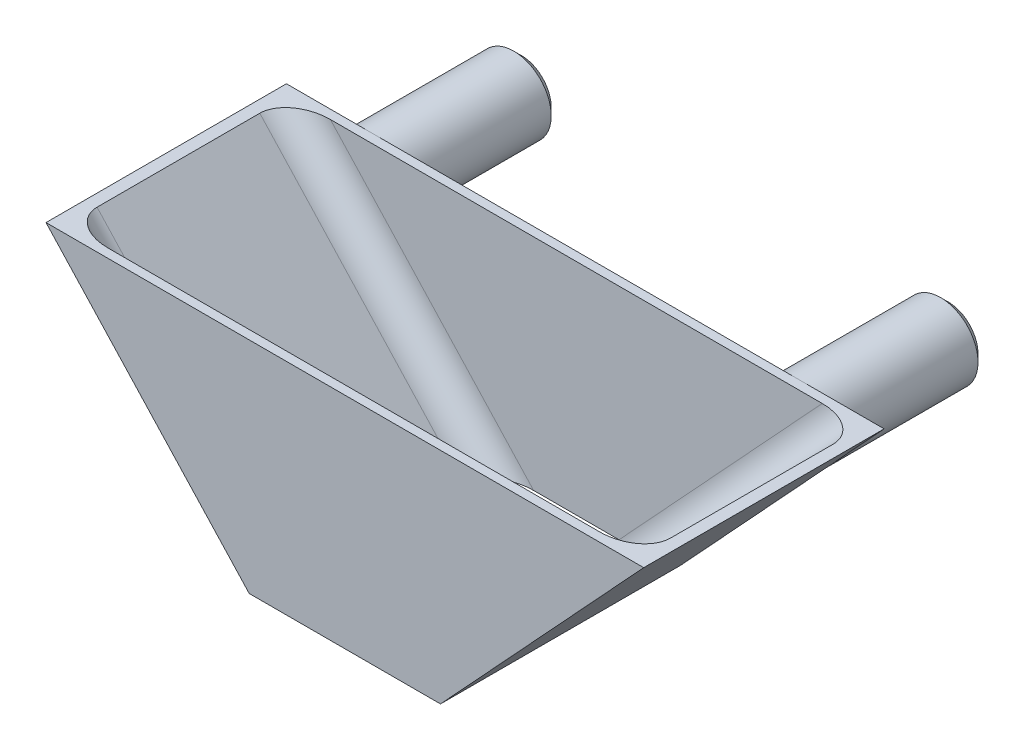
ISO-10303-21;
HEADER;
FILE_DESCRIPTION(('STEP AP214'),'2;1');
FILE_NAME('part.step','',(''),(''),'','','');
FILE_SCHEMA(('AUTOMOTIVE_DESIGN { 1 0 10303 214 1 1 1 1 }'));
ENDSEC;
DATA;
#1=APPLICATION_CONTEXT('core data for automotive mechanical design processes');
#2=APPLICATION_PROTOCOL_DEFINITION('international standard','automotive_design',2000,#1);
#3=PRODUCT_CONTEXT('',#1,'mechanical');
#4=PRODUCT('Part','Part','',(#3));
#5=PRODUCT_RELATED_PRODUCT_CATEGORY('part','',(#4));
#6=PRODUCT_DEFINITION_FORMATION('','',#4);
#7=PRODUCT_DEFINITION_CONTEXT('part definition',#1,'design');
#8=PRODUCT_DEFINITION('design','',#6,#7);
#9=PRODUCT_DEFINITION_SHAPE('','',#8);
#10=(LENGTH_UNIT() NAMED_UNIT(*) SI_UNIT(.MILLI.,.METRE.));
#11=(NAMED_UNIT(*) PLANE_ANGLE_UNIT() SI_UNIT($,.RADIAN.));
#12=(NAMED_UNIT(*) SI_UNIT($,.STERADIAN.) SOLID_ANGLE_UNIT());
#13=UNCERTAINTY_MEASURE_WITH_UNIT(LENGTH_MEASURE(1.E-05),#10,'distance_accuracy_value','');
#14=(GEOMETRIC_REPRESENTATION_CONTEXT(3) GLOBAL_UNCERTAINTY_ASSIGNED_CONTEXT((#13)) GLOBAL_UNIT_ASSIGNED_CONTEXT((#10,
#11,#12)) REPRESENTATION_CONTEXT('',''));
#15=CARTESIAN_POINT('',(0.,0.,0.));
#16=DIRECTION('',(0.,0.,1.));
#17=DIRECTION('',(1.,0.,0.));
#18=AXIS2_PLACEMENT_3D('',#15,#16,#17);
#19=CARTESIAN_POINT('',(0.,0.,0.));
#20=DIRECTION('',(0.,0.,-1.));
#21=DIRECTION('',(-1.,0.,0.));
#22=AXIS2_PLACEMENT_3D('',#19,#20,#21);
#23=PLANE('',#22);
#24=DIRECTION('',(0.679109253274506,-0.734037207583473,0.));
#25=VECTOR('',#24,1.);
#26=CARTESIAN_POINT('',(-6.4,0.,0.));
#27=LINE('',#26,#25);
#28=CARTESIAN_POINT('',(-16.1163459448073,10.5022268668137,0.));
#29=VERTEX_POINT('',#28);
#30=CARTESIAN_POINT('',(-6.4,0.,0.));
#31=VERTEX_POINT('',#30);
#32=EDGE_CURVE('E146',#29,#31,#27,.T.);
#33=ORIENTED_EDGE('',*,*,#32,.F.);
#34=CARTESIAN_POINT('',(-14.2812529258486,12.2,0.));
#35=DIRECTION('',(0.,0.,-1.));
#36=DIRECTION('',(-1.,0.,0.));
#37=AXIS2_PLACEMENT_3D('',#34,#35,#36);
#38=CIRCLE('',#37,2.5);
#39=CARTESIAN_POINT('',(-14.2812529258486,14.7,0.));
#40=VERTEX_POINT('',#39);
#41=EDGE_CURVE('E49',#40,#29,#38,.T.);
#42=ORIENTED_EDGE('',*,*,#41,.F.);
#43=DIRECTION('',(-1.,0.,0.));
#44=VECTOR('',#43,1.);
#45=CARTESIAN_POINT('',(-20.,14.7,0.));
#46=LINE('',#45,#44);
#47=CARTESIAN_POINT('',(14.2812529258486,14.7,0.));
#48=VERTEX_POINT('',#47);
#49=EDGE_CURVE('E143',#48,#40,#46,.T.);
#50=ORIENTED_EDGE('',*,*,#49,.F.);
#51=CARTESIAN_POINT('',(14.2812529258486,12.2,0.));
#52=DIRECTION('',(0.,0.,-1.));
#53=DIRECTION('',(-1.,0.,0.));
#54=AXIS2_PLACEMENT_3D('',#51,#52,#53);
#55=CIRCLE('',#54,2.5);
#56=CARTESIAN_POINT('',(16.1163459448073,10.5022268668137,0.));
#57=VERTEX_POINT('',#56);
#58=EDGE_CURVE('E57',#57,#48,#55,.T.);
#59=ORIENTED_EDGE('',*,*,#58,.F.);
#60=DIRECTION('',(0.679109253274506,0.734037207583473,0.));
#61=VECTOR('',#60,1.);
#62=CARTESIAN_POINT('',(20.,14.7,0.));
#63=LINE('',#62,#61);
#64=CARTESIAN_POINT('',(6.4,0.,0.));
#65=VERTEX_POINT('',#64);
#66=EDGE_CURVE('E156',#65,#57,#63,.T.);
#67=ORIENTED_EDGE('',*,*,#66,.F.);
#68=DIRECTION('',(1.,0.,0.));
#69=VECTOR('',#68,1.);
#70=CARTESIAN_POINT('',(6.4,0.,0.));
#71=LINE('',#70,#69);
#72=EDGE_CURVE('E477',#31,#65,#71,.T.);
#73=ORIENTED_EDGE('',*,*,#72,.F.);
#74=EDGE_LOOP('',(#33,#42,#50,#59,#67,#73));
#75=FACE_BOUND('',#74,.T.);
#76=ADVANCED_FACE('F35',(#75),#23,.T.);
#77=EDGE_CURVE('E148',#48,#57,#55,.T.);
#78=ORIENTED_EDGE('',*,*,#77,.F.);
#79=CARTESIAN_POINT('',(20.,14.7,0.));
#80=VERTEX_POINT('',#79);
#81=EDGE_CURVE('E158',#80,#48,#46,.T.);
#82=ORIENTED_EDGE('',*,*,#81,.F.);
#83=EDGE_CURVE('E451',#57,#80,#63,.T.);
#84=ORIENTED_EDGE('',*,*,#83,.F.);
#85=EDGE_LOOP('',(#78,#82,#84));
#86=FACE_BOUND('',#85,.T.);
#87=ADVANCED_FACE('F233',(#86),#23,.T.);
#88=CARTESIAN_POINT('',(6.4,0.,16.09));
#89=DIRECTION('',(0.,1.,0.));
#90=DIRECTION('',(0.,0.,1.));
#91=AXIS2_PLACEMENT_3D('',#88,#89,#90);
#92=PLANE('',#91);
#93=ORIENTED_EDGE('',*,*,#72,.T.);
#94=DIRECTION('',(0.,0.,-1.));
#95=VECTOR('',#94,1.);
#96=CARTESIAN_POINT('',(6.4,0.,16.09));
#97=LINE('',#96,#95);
#98=CARTESIAN_POINT('',(6.4,0.,16.09));
#99=VERTEX_POINT('',#98);
#100=EDGE_CURVE('E176',#99,#65,#97,.T.);
#101=ORIENTED_EDGE('',*,*,#100,.F.);
#102=DIRECTION('',(1.,0.,0.));
#103=VECTOR('',#102,1.);
#104=CARTESIAN_POINT('',(6.4,0.,16.09));
#105=LINE('',#104,#103);
#106=CARTESIAN_POINT('',(-6.4,0.,16.09));
#107=VERTEX_POINT('',#106);
#108=EDGE_CURVE('E167',#107,#99,#105,.T.);
#109=ORIENTED_EDGE('',*,*,#108,.F.);
#110=DIRECTION('',(0.,0.,-1.));
#111=VECTOR('',#110,1.);
#112=CARTESIAN_POINT('',(-6.4,0.,16.09));
#113=LINE('',#112,#111);
#114=EDGE_CURVE('E168',#107,#31,#113,.T.);
#115=ORIENTED_EDGE('',*,*,#114,.T.);
#116=EDGE_LOOP('',(#93,#101,#109,#115));
#117=FACE_BOUND('',#116,.T.);
#118=DIRECTION('',(1.,0.,0.));
#119=VECTOR('',#118,1.);
#120=CARTESIAN_POINT('',(0.,0.,0.6));
#121=LINE('',#120,#119);
#122=CARTESIAN_POINT('',(-2.85794521975328,0.,0.6));
#123=VERTEX_POINT('',#122);
#124=CARTESIAN_POINT('',(2.85794521975327,0.,0.6));
#125=VERTEX_POINT('',#124);
#126=EDGE_CURVE('E455',#123,#125,#121,.T.);
#127=ORIENTED_EDGE('',*,*,#126,.F.);
#128=CARTESIAN_POINT('',(-2.85794521975327,0.,2.6));
#129=DIRECTION('',(0.,1.,0.));
#130=DIRECTION('',(1.,0.,0.));
#131=AXIS2_PLACEMENT_3D('',#128,#129,#130);
#132=ELLIPSE('',#131,2.72465752326671,2.);
#133=CARTESIAN_POINT('',(-5.58260274301999,0.,2.6));
#134=VERTEX_POINT('',#133);
#135=EDGE_CURVE('E211',#123,#134,#132,.T.);
#136=ORIENTED_EDGE('',*,*,#135,.T.);
#137=DIRECTION('',(0.,0.,-1.));
#138=VECTOR('',#137,1.);
#139=CARTESIAN_POINT('',(-5.58260274301999,0.,16.09));
#140=LINE('',#139,#138);
#141=CARTESIAN_POINT('',(-5.58260274301999,0.,13.49));
#142=VERTEX_POINT('',#141);
#143=EDGE_CURVE('E471',#142,#134,#140,.T.);
#144=ORIENTED_EDGE('',*,*,#143,.F.);
#145=CARTESIAN_POINT('',(-2.85794521975327,0.,13.49));
#146=DIRECTION('',(0.,1.,0.));
#147=DIRECTION('',(-1.,0.,0.));
#148=AXIS2_PLACEMENT_3D('',#145,#146,#147);
#149=ELLIPSE('',#148,2.72465752326671,2.);
#150=CARTESIAN_POINT('',(-2.85794521975327,0.,15.49));
#151=VERTEX_POINT('',#150);
#152=EDGE_CURVE('E193',#142,#151,#149,.T.);
#153=ORIENTED_EDGE('',*,*,#152,.T.);
#154=DIRECTION('',(1.,0.,0.));
#155=VECTOR('',#154,1.);
#156=CARTESIAN_POINT('',(0.,0.,15.49));
#157=LINE('',#156,#155);
#158=CARTESIAN_POINT('',(2.85794521975328,0.,15.49));
#159=VERTEX_POINT('',#158);
#160=EDGE_CURVE('E468',#151,#159,#157,.T.);
#161=ORIENTED_EDGE('',*,*,#160,.T.);
#162=CARTESIAN_POINT('',(2.85794521975327,0.,13.49));
#163=DIRECTION('',(0.,1.,0.));
#164=DIRECTION('',(-1.,0.,0.));
#165=AXIS2_PLACEMENT_3D('',#162,#163,#164);
#166=ELLIPSE('',#165,2.72465752326671,2.);
#167=CARTESIAN_POINT('',(5.58260274301998,0.,13.49));
#168=VERTEX_POINT('',#167);
#169=EDGE_CURVE('E191',#159,#168,#166,.T.);
#170=ORIENTED_EDGE('',*,*,#169,.T.);
#171=DIRECTION('',(0.,0.,-1.));
#172=VECTOR('',#171,1.);
#173=CARTESIAN_POINT('',(5.58260274301998,0.,16.09));
#174=LINE('',#173,#172);
#175=CARTESIAN_POINT('',(5.58260274301998,0.,2.6));
#176=VERTEX_POINT('',#175);
#177=EDGE_CURVE('E464',#168,#176,#174,.T.);
#178=ORIENTED_EDGE('',*,*,#177,.T.);
#179=CARTESIAN_POINT('',(2.85794521975327,0.,2.6));
#180=DIRECTION('',(0.,1.,0.));
#181=DIRECTION('',(1.,0.,0.));
#182=AXIS2_PLACEMENT_3D('',#179,#180,#181);
#183=ELLIPSE('',#182,2.72465752326671,2.);
#184=EDGE_CURVE('E209',#176,#125,#183,.T.);
#185=ORIENTED_EDGE('',*,*,#184,.T.);
#186=EDGE_LOOP('',(#127,#136,#144,#153,#161,#170,#178,#185));
#187=FACE_BOUND('',#186,.T.);
#188=ADVANCED_FACE('F238',(#117,#187),#92,.F.);
#189=CARTESIAN_POINT('',(-20.,14.7,16.09));
#190=DIRECTION('',(0.,-1.,0.));
#191=DIRECTION('',(0.,0.,-1.));
#192=AXIS2_PLACEMENT_3D('',#189,#190,#191);
#193=PLANE('',#192);
#194=ORIENTED_EDGE('',*,*,#81,.T.);
#195=ORIENTED_EDGE('',*,*,#49,.T.);
#196=CARTESIAN_POINT('',(-20.,14.7,0.));
#197=VERTEX_POINT('',#196);
#198=EDGE_CURVE('E150',#40,#197,#46,.T.);
#199=ORIENTED_EDGE('',*,*,#198,.T.);
#200=DIRECTION('',(0.,0.,-1.));
#201=VECTOR('',#200,1.);
#202=CARTESIAN_POINT('',(-20.,14.7,16.09));
#203=LINE('',#202,#201);
#204=CARTESIAN_POINT('',(-20.,14.7,16.09));
#205=VERTEX_POINT('',#204);
#206=EDGE_CURVE('E171',#205,#197,#203,.T.);
#207=ORIENTED_EDGE('',*,*,#206,.F.);
#208=DIRECTION('',(-1.,0.,0.));
#209=VECTOR('',#208,1.);
#210=CARTESIAN_POINT('',(-20.,14.7,16.09));
#211=LINE('',#210,#209);
#212=CARTESIAN_POINT('',(20.,14.7,16.09));
#213=VERTEX_POINT('',#212);
#214=EDGE_CURVE('E485',#213,#205,#211,.T.);
#215=ORIENTED_EDGE('',*,*,#214,.F.);
#216=DIRECTION('',(0.,0.,-1.));
#217=VECTOR('',#216,1.);
#218=CARTESIAN_POINT('',(20.,14.7,16.09));
#219=LINE('',#218,#217);
#220=EDGE_CURVE('E174',#213,#80,#219,.T.);
#221=ORIENTED_EDGE('',*,*,#220,.T.);
#222=EDGE_LOOP('',(#194,#195,#199,#207,#215,#221));
#223=FACE_BOUND('',#222,.T.);
#224=DIRECTION('',(-1.,0.,0.));
#225=VECTOR('',#224,1.);
#226=CARTESIAN_POINT('',(0.,14.7,0.6));
#227=LINE('',#226,#225);
#228=CARTESIAN_POINT('',(16.4579452197533,14.7,0.6));
#229=VERTEX_POINT('',#228);
#230=CARTESIAN_POINT('',(-16.4579452197533,14.7,0.6));
#231=VERTEX_POINT('',#230);
#232=EDGE_CURVE('E458',#229,#231,#227,.T.);
#233=ORIENTED_EDGE('',*,*,#232,.F.);
#234=CARTESIAN_POINT('',(16.4579452197533,14.7,2.6));
#235=DIRECTION('',(0.,-1.,0.));
#236=DIRECTION('',(1.,0.,0.));
#237=AXIS2_PLACEMENT_3D('',#234,#235,#236);
#238=ELLIPSE('',#237,2.72465752326671,2.);
#239=CARTESIAN_POINT('',(19.18260274302,14.7,2.6));
#240=VERTEX_POINT('',#239);
#241=EDGE_CURVE('E207',#229,#240,#238,.T.);
#242=ORIENTED_EDGE('',*,*,#241,.T.);
#243=DIRECTION('',(0.,0.,-1.));
#244=VECTOR('',#243,1.);
#245=CARTESIAN_POINT('',(19.18260274302,14.7,16.09));
#246=LINE('',#245,#244);
#247=CARTESIAN_POINT('',(19.18260274302,14.7,13.49));
#248=VERTEX_POINT('',#247);
#249=EDGE_CURVE('E461',#248,#240,#246,.T.);
#250=ORIENTED_EDGE('',*,*,#249,.F.);
#251=CARTESIAN_POINT('',(16.4579452197533,14.7,13.49));
#252=DIRECTION('',(0.,-1.,0.));
#253=DIRECTION('',(-1.,0.,0.));
#254=AXIS2_PLACEMENT_3D('',#251,#252,#253);
#255=ELLIPSE('',#254,2.72465752326671,2.);
#256=CARTESIAN_POINT('',(16.4579452197533,14.7,15.49));
#257=VERTEX_POINT('',#256);
#258=EDGE_CURVE('E189',#248,#257,#255,.T.);
#259=ORIENTED_EDGE('',*,*,#258,.T.);
#260=DIRECTION('',(-1.,0.,0.));
#261=VECTOR('',#260,1.);
#262=CARTESIAN_POINT('',(0.,14.7,15.49));
#263=LINE('',#262,#261);
#264=CARTESIAN_POINT('',(-16.4579452197533,14.7,15.49));
#265=VERTEX_POINT('',#264);
#266=EDGE_CURVE('E472',#257,#265,#263,.T.);
#267=ORIENTED_EDGE('',*,*,#266,.T.);
#268=CARTESIAN_POINT('',(-16.4579452197533,14.7,13.49));
#269=DIRECTION('',(0.,-1.,0.));
#270=DIRECTION('',(-1.,0.,0.));
#271=AXIS2_PLACEMENT_3D('',#268,#269,#270);
#272=ELLIPSE('',#271,2.72465752326671,2.);
#273=CARTESIAN_POINT('',(-19.18260274302,14.7,13.49));
#274=VERTEX_POINT('',#273);
#275=EDGE_CURVE('E195',#265,#274,#272,.T.);
#276=ORIENTED_EDGE('',*,*,#275,.T.);
#277=DIRECTION('',(0.,0.,-1.));
#278=VECTOR('',#277,1.);
#279=CARTESIAN_POINT('',(-19.18260274302,14.7,16.09));
#280=LINE('',#279,#278);
#281=CARTESIAN_POINT('',(-19.18260274302,14.7,2.6));
#282=VERTEX_POINT('',#281);
#283=EDGE_CURVE('E465',#274,#282,#280,.T.);
#284=ORIENTED_EDGE('',*,*,#283,.T.);
#285=CARTESIAN_POINT('',(-16.4579452197533,14.7,2.6));
#286=DIRECTION('',(0.,-1.,0.));
#287=DIRECTION('',(1.,0.,0.));
#288=AXIS2_PLACEMENT_3D('',#285,#286,#287);
#289=ELLIPSE('',#288,2.72465752326671,2.);
#290=EDGE_CURVE('E213',#282,#231,#289,.T.);
#291=ORIENTED_EDGE('',*,*,#290,.T.);
#292=EDGE_LOOP('',(#233,#242,#250,#259,#267,#276,#284,#291));
#293=FACE_BOUND('',#292,.T.);
#294=ADVANCED_FACE('F159',(#223,#293),#193,.F.);
#295=CARTESIAN_POINT('',(20.,14.7,16.09));
#296=DIRECTION('',(-0.734037207583473,0.679109253274506,0.));
#297=DIRECTION('',(-0.679109253274506,-0.734037207583473,0.));
#298=AXIS2_PLACEMENT_3D('',#295,#296,#297);
#299=PLANE('',#298);
#300=ORIENTED_EDGE('',*,*,#66,.T.);
#301=ORIENTED_EDGE('',*,*,#83,.T.);
#302=ORIENTED_EDGE('',*,*,#220,.F.);
#303=DIRECTION('',(0.679109253274506,0.734037207583473,0.));
#304=VECTOR('',#303,1.);
#305=CARTESIAN_POINT('',(20.,14.7,16.09));
#306=LINE('',#305,#304);
#307=EDGE_CURVE('E483',#99,#213,#306,.T.);
#308=ORIENTED_EDGE('',*,*,#307,.F.);
#309=ORIENTED_EDGE('',*,*,#100,.T.);
#310=EDGE_LOOP('',(#300,#301,#302,#308,#309));
#311=FACE_BOUND('',#310,.T.);
#312=ADVANCED_FACE('F257',(#311),#299,.F.);
#313=CARTESIAN_POINT('',(-6.4,0.,16.09));
#314=DIRECTION('',(0.734037207583473,0.679109253274506,0.));
#315=DIRECTION('',(-0.679109253274506,0.734037207583473,0.));
#316=AXIS2_PLACEMENT_3D('',#313,#314,#315);
#317=PLANE('',#316);
#318=EDGE_CURVE('E152',#197,#29,#27,.T.);
#319=ORIENTED_EDGE('',*,*,#318,.T.);
#320=ORIENTED_EDGE('',*,*,#32,.T.);
#321=ORIENTED_EDGE('',*,*,#114,.F.);
#322=DIRECTION('',(0.679109253274506,-0.734037207583473,0.));
#323=VECTOR('',#322,1.);
#324=CARTESIAN_POINT('',(-6.4,0.,16.09));
#325=LINE('',#324,#323);
#326=EDGE_CURVE('E172',#205,#107,#325,.T.);
#327=ORIENTED_EDGE('',*,*,#326,.F.);
#328=ORIENTED_EDGE('',*,*,#206,.T.);
#329=EDGE_LOOP('',(#319,#320,#321,#327,#328));
#330=FACE_BOUND('',#329,.T.);
#331=ADVANCED_FACE('F252',(#330),#317,.F.);
#332=CARTESIAN_POINT('',(0.,0.,16.09));
#333=DIRECTION('',(0.,0.,-1.));
#334=DIRECTION('',(-1.,0.,0.));
#335=AXIS2_PLACEMENT_3D('',#332,#333,#334);
#336=PLANE('',#335);
#337=ORIENTED_EDGE('',*,*,#108,.T.);
#338=ORIENTED_EDGE('',*,*,#307,.T.);
#339=ORIENTED_EDGE('',*,*,#214,.T.);
#340=ORIENTED_EDGE('',*,*,#326,.T.);
#341=EDGE_LOOP('',(#337,#338,#339,#340));
#342=FACE_BOUND('',#341,.T.);
#343=ADVANCED_FACE('F244',(#342),#336,.F.);
#344=ORIENTED_EDGE('',*,*,#198,.F.);
#345=CARTESIAN_POINT('',(-14.2812529258486,12.2,0.));
#346=DIRECTION('',(0.,0.,-1.));
#347=DIRECTION('',(-1.,0.,0.));
#348=AXIS2_PLACEMENT_3D('',#345,#346,#347);
#349=CIRCLE('',#348,2.5);
#350=EDGE_CURVE('E134',#40,#29,#349,.F.);
#351=ORIENTED_EDGE('',*,*,#350,.T.);
#352=ORIENTED_EDGE('',*,*,#318,.F.);
#353=EDGE_LOOP('',(#344,#351,#352));
#354=FACE_BOUND('',#353,.T.);
#355=ADVANCED_FACE('F151',(#354),#23,.T.);
#356=CARTESIAN_POINT('',(19.5595776754499,15.1074655519647,16.09));
#357=DIRECTION('',(-0.734037207583473,0.679109253274506,0.));
#358=DIRECTION('',(-0.679109253274506,-0.734037207583473,0.));
#359=AXIS2_PLACEMENT_3D('',#356,#357,#358);
#360=PLANE('',#359);
#361=ORIENTED_EDGE('',*,*,#249,.T.);
#362=DIRECTION('',(0.679109253274506,0.734037207583473,0.));
#363=VECTOR('',#362,1.);
#364=CARTESIAN_POINT('',(19.5595776754499,15.1074655519647,2.6));
#365=LINE('',#364,#363);
#366=EDGE_CURVE('E203',#240,#176,#365,.F.);
#367=ORIENTED_EDGE('',*,*,#366,.T.);
#368=ORIENTED_EDGE('',*,*,#177,.F.);
#369=DIRECTION('',(0.679109253274506,0.734037207583473,0.));
#370=VECTOR('',#369,1.);
#371=CARTESIAN_POINT('',(19.18260274302,14.7,13.49));
#372=LINE('',#371,#370);
#373=EDGE_CURVE('E179',#168,#248,#372,.T.);
#374=ORIENTED_EDGE('',*,*,#373,.T.);
#375=EDGE_LOOP('',(#361,#367,#368,#374));
#376=FACE_BOUND('',#375,.T.);
#377=ADVANCED_FACE('F243',(#376),#360,.T.);
#378=CARTESIAN_POINT('',(-5.95957767544992,0.407465551964702,16.09));
#379=DIRECTION('',(0.734037207583473,0.679109253274506,0.));
#380=DIRECTION('',(-0.679109253274506,0.734037207583473,0.));
#381=AXIS2_PLACEMENT_3D('',#378,#379,#380);
#382=PLANE('',#381);
#383=ORIENTED_EDGE('',*,*,#143,.T.);
#384=DIRECTION('',(0.679109253274506,-0.734037207583473,0.));
#385=VECTOR('',#384,1.);
#386=CARTESIAN_POINT('',(-5.95957767544992,0.407465551964702,2.6));
#387=LINE('',#386,#385);
#388=EDGE_CURVE('E205',#134,#282,#387,.F.);
#389=ORIENTED_EDGE('',*,*,#388,.T.);
#390=ORIENTED_EDGE('',*,*,#283,.F.);
#391=DIRECTION('',(0.679109253274506,-0.734037207583473,0.));
#392=VECTOR('',#391,1.);
#393=CARTESIAN_POINT('',(-5.58260274301999,0.,13.49));
#394=LINE('',#393,#392);
#395=EDGE_CURVE('E186',#274,#142,#394,.T.);
#396=ORIENTED_EDGE('',*,*,#395,.T.);
#397=EDGE_LOOP('',(#383,#389,#390,#396));
#398=FACE_BOUND('',#397,.T.);
#399=ADVANCED_FACE('F249',(#398),#382,.T.);
#400=CARTESIAN_POINT('',(0.,0.,15.49));
#401=DIRECTION('',(0.,0.,-1.));
#402=DIRECTION('',(-1.,0.,0.));
#403=AXIS2_PLACEMENT_3D('',#400,#401,#402);
#404=PLANE('',#403);
#405=ORIENTED_EDGE('',*,*,#266,.F.);
#406=DIRECTION('',(0.679109253274506,0.734037207583473,0.));
#407=VECTOR('',#406,1.);
#408=CARTESIAN_POINT('',(4.11452832785304,1.35821850654901,15.49));
#409=LINE('',#408,#407);
#410=EDGE_CURVE('E184',#257,#159,#409,.F.);
#411=ORIENTED_EDGE('',*,*,#410,.T.);
#412=ORIENTED_EDGE('',*,*,#160,.F.);
#413=DIRECTION('',(0.679109253274506,-0.734037207583473,0.));
#414=VECTOR('',#413,1.);
#415=CARTESIAN_POINT('',(-17.714528327853,16.058218506549,15.49));
#416=LINE('',#415,#414);
#417=EDGE_CURVE('E182',#151,#265,#416,.F.);
#418=ORIENTED_EDGE('',*,*,#417,.T.);
#419=EDGE_LOOP('',(#405,#411,#412,#418));
#420=FACE_BOUND('',#419,.T.);
#421=ADVANCED_FACE('F265',(#420),#404,.T.);
#422=CARTESIAN_POINT('',(0.,0.,0.6));
#423=DIRECTION('',(0.,0.,-1.));
#424=DIRECTION('',(-1.,0.,0.));
#425=AXIS2_PLACEMENT_3D('',#422,#423,#424);
#426=PLANE('',#425);
#427=ORIENTED_EDGE('',*,*,#126,.T.);
#428=DIRECTION('',(0.679109253274506,0.734037207583473,0.));
#429=VECTOR('',#428,1.);
#430=CARTESIAN_POINT('',(1.5398912418314,-1.42466128495967,0.6));
#431=LINE('',#430,#429);
#432=EDGE_CURVE('E200',#125,#229,#431,.T.);
#433=ORIENTED_EDGE('',*,*,#432,.T.);
#434=ORIENTED_EDGE('',*,*,#232,.T.);
#435=DIRECTION('',(0.679109253274506,-0.734037207583473,0.));
#436=VECTOR('',#435,1.);
#437=CARTESIAN_POINT('',(-1.53989124183141,-1.42466128495967,0.6));
#438=LINE('',#437,#436);
#439=EDGE_CURVE('E197',#231,#123,#438,.T.);
#440=ORIENTED_EDGE('',*,*,#439,.T.);
#441=EDGE_LOOP('',(#427,#433,#434,#440));
#442=FACE_BOUND('',#441,.T.);
#443=ADVANCED_FACE('F261',(#442),#426,.F.);
#444=CARTESIAN_POINT('',(18.091503260283,16.4656840585137,13.49));
#445=DIRECTION('',(-0.679109253274506,-0.734037207583473,0.));
#446=DIRECTION('',(0.734037207583473,-0.679109253274506,0.));
#447=AXIS2_PLACEMENT_3D('',#444,#445,#446);
#448=CYLINDRICAL_SURFACE('',#447,2.);
#449=ORIENTED_EDGE('',*,*,#169,.F.);
#450=ORIENTED_EDGE('',*,*,#410,.F.);
#451=ORIENTED_EDGE('',*,*,#258,.F.);
#452=ORIENTED_EDGE('',*,*,#373,.F.);
#453=EDGE_LOOP('',(#449,#450,#451,#452));
#454=FACE_BOUND('',#453,.T.);
#455=ADVANCED_FACE('F264',(#454),#448,.F.);
#456=CARTESIAN_POINT('',(-4.49150326028297,1.76568405851371,13.49));
#457=DIRECTION('',(-0.679109253274506,0.734037207583473,0.));
#458=DIRECTION('',(-0.734037207583473,-0.679109253274506,0.));
#459=AXIS2_PLACEMENT_3D('',#456,#457,#458);
#460=CYLINDRICAL_SURFACE('',#459,2.);
#461=ORIENTED_EDGE('',*,*,#275,.F.);
#462=ORIENTED_EDGE('',*,*,#417,.F.);
#463=ORIENTED_EDGE('',*,*,#152,.F.);
#464=ORIENTED_EDGE('',*,*,#395,.F.);
#465=EDGE_LOOP('',(#461,#462,#463,#464));
#466=FACE_BOUND('',#465,.T.);
#467=ADVANCED_FACE('F345',(#466),#460,.F.);
#468=CARTESIAN_POINT('',(1.5398912418314,-1.42466128495967,2.6));
#469=DIRECTION('',(0.679109253274506,0.734037207583473,0.));
#470=DIRECTION('',(-0.734037207583473,0.679109253274506,0.));
#471=AXIS2_PLACEMENT_3D('',#468,#469,#470);
#472=CYLINDRICAL_SURFACE('',#471,2.);
#473=ORIENTED_EDGE('',*,*,#184,.F.);
#474=ORIENTED_EDGE('',*,*,#366,.F.);
#475=ORIENTED_EDGE('',*,*,#241,.F.);
#476=ORIENTED_EDGE('',*,*,#432,.F.);
#477=EDGE_LOOP('',(#473,#474,#475,#476));
#478=FACE_BOUND('',#477,.T.);
#479=ADVANCED_FACE('F336',(#478),#472,.F.);
#480=CARTESIAN_POINT('',(-1.53989124183141,-1.42466128495967,2.6));
#481=DIRECTION('',(0.679109253274506,-0.734037207583473,0.));
#482=DIRECTION('',(0.734037207583473,0.679109253274506,0.));
#483=AXIS2_PLACEMENT_3D('',#480,#481,#482);
#484=CYLINDRICAL_SURFACE('',#483,2.);
#485=ORIENTED_EDGE('',*,*,#290,.F.);
#486=ORIENTED_EDGE('',*,*,#388,.F.);
#487=ORIENTED_EDGE('',*,*,#135,.F.);
#488=ORIENTED_EDGE('',*,*,#439,.F.);
#489=EDGE_LOOP('',(#485,#486,#487,#488));
#490=FACE_BOUND('',#489,.T.);
#491=ADVANCED_FACE('F277',(#490),#484,.F.);
#492=CARTESIAN_POINT('',(14.2812529258486,12.2,-10.));
#493=DIRECTION('',(0.,0.,1.));
#494=DIRECTION('',(1.,0.,0.));
#495=AXIS2_PLACEMENT_3D('',#492,#493,#494);
#496=CYLINDRICAL_SURFACE('',#495,2.5);
#497=CARTESIAN_POINT('',(14.2812529258486,12.2,-9.5));
#498=DIRECTION('',(0.,0.,-1.));
#499=DIRECTION('',(-1.,0.,0.));
#500=AXIS2_PLACEMENT_3D('',#497,#498,#499);
#501=CIRCLE('',#500,2.5);
#502=CARTESIAN_POINT('',(11.7812529258486,12.2,-9.5));
#503=VERTEX_POINT('',#502);
#504=EDGE_CURVE('E217',#503,#503,#501,.F.);
#505=ORIENTED_EDGE('',*,*,#504,.T.);
#506=EDGE_LOOP('',(#505));
#507=FACE_BOUND('',#506,.T.);
#508=ORIENTED_EDGE('',*,*,#77,.T.);
#509=ORIENTED_EDGE('',*,*,#58,.T.);
#510=EDGE_LOOP('',(#508,#509));
#511=FACE_BOUND('',#510,.T.);
#512=ADVANCED_FACE('F273',(#507,#511),#496,.T.);
#513=CARTESIAN_POINT('',(14.2812529258486,12.2,-10.));
#514=DIRECTION('',(0.,0.,-1.));
#515=DIRECTION('',(-1.,0.,0.));
#516=AXIS2_PLACEMENT_3D('',#513,#514,#515);
#517=PLANE('',#516);
#518=CARTESIAN_POINT('',(14.2812529258486,12.2,-10.));
#519=DIRECTION('',(0.,0.,-1.));
#520=DIRECTION('',(-1.,0.,0.));
#521=AXIS2_PLACEMENT_3D('',#518,#519,#520);
#522=CIRCLE('',#521,2.);
#523=CARTESIAN_POINT('',(12.2812529258486,12.2,-10.));
#524=VERTEX_POINT('',#523);
#525=EDGE_CURVE('E140',#524,#524,#522,.T.);
#526=ORIENTED_EDGE('',*,*,#525,.T.);
#527=EDGE_LOOP('',(#526));
#528=FACE_BOUND('',#527,.T.);
#529=ADVANCED_FACE('F276',(#528),#517,.T.);
#530=CARTESIAN_POINT('',(-14.2812529258486,12.2,-10.));
#531=DIRECTION('',(0.,0.,1.));
#532=DIRECTION('',(1.,0.,0.));
#533=AXIS2_PLACEMENT_3D('',#530,#531,#532);
#534=CYLINDRICAL_SURFACE('',#533,2.5);
#535=CARTESIAN_POINT('',(-14.2812529258486,12.2,-9.50000000000001));
#536=DIRECTION('',(0.,0.,-1.));
#537=DIRECTION('',(-1.,0.,0.));
#538=AXIS2_PLACEMENT_3D('',#535,#536,#537);
#539=CIRCLE('',#538,2.5);
#540=CARTESIAN_POINT('',(-16.7812529258486,12.2,-9.50000000000001));
#541=VERTEX_POINT('',#540);
#542=EDGE_CURVE('E11',#541,#541,#539,.F.);
#543=ORIENTED_EDGE('',*,*,#542,.T.);
#544=EDGE_LOOP('',(#543));
#545=FACE_BOUND('',#544,.T.);
#546=ORIENTED_EDGE('',*,*,#41,.T.);
#547=ORIENTED_EDGE('',*,*,#350,.F.);
#548=EDGE_LOOP('',(#546,#547));
#549=FACE_BOUND('',#548,.T.);
#550=ADVANCED_FACE('F135',(#545,#549),#534,.T.);
#551=CARTESIAN_POINT('',(-14.2812529258486,12.2,-10.));
#552=DIRECTION('',(0.,0.,-1.));
#553=DIRECTION('',(-1.,0.,0.));
#554=AXIS2_PLACEMENT_3D('',#551,#552,#553);
#555=PLANE('',#554);
#556=CARTESIAN_POINT('',(-14.2812529258486,12.2,-10.));
#557=DIRECTION('',(0.,0.,-1.));
#558=DIRECTION('',(-1.,0.,0.));
#559=AXIS2_PLACEMENT_3D('',#556,#557,#558);
#560=CIRCLE('',#559,2.00000000000001);
#561=CARTESIAN_POINT('',(-16.2812529258486,12.2,-10.));
#562=VERTEX_POINT('',#561);
#563=EDGE_CURVE('E43',#562,#562,#560,.T.);
#564=ORIENTED_EDGE('',*,*,#563,.T.);
#565=EDGE_LOOP('',(#564));
#566=FACE_BOUND('',#565,.T.);
#567=ADVANCED_FACE('F222',(#566),#555,.T.);
#568=CARTESIAN_POINT('',(14.2812529258486,12.2,-10.));
#569=DIRECTION('',(0.,0.,1.));
#570=DIRECTION('',(1.,0.,0.));
#571=AXIS2_PLACEMENT_3D('',#568,#569,#570);
#572=CONICAL_SURFACE('',#571,2.,0.785398163397447);
#573=ORIENTED_EDGE('',*,*,#504,.F.);
#574=EDGE_LOOP('',(#573));
#575=FACE_BOUND('',#574,.T.);
#576=ORIENTED_EDGE('',*,*,#525,.F.);
#577=EDGE_LOOP('',(#576));
#578=FACE_BOUND('',#577,.T.);
#579=ADVANCED_FACE('F225',(#575,#578),#572,.T.);
#580=CARTESIAN_POINT('',(-14.2812529258486,12.2,-10.));
#581=DIRECTION('',(0.,0.,1.));
#582=DIRECTION('',(1.,0.,0.));
#583=AXIS2_PLACEMENT_3D('',#580,#581,#582);
#584=CONICAL_SURFACE('',#583,2.00000000000001,0.785398163397447);
#585=ORIENTED_EDGE('',*,*,#542,.F.);
#586=EDGE_LOOP('',(#585));
#587=FACE_BOUND('',#586,.T.);
#588=ORIENTED_EDGE('',*,*,#563,.F.);
#589=EDGE_LOOP('',(#588));
#590=FACE_BOUND('',#589,.T.);
#591=ADVANCED_FACE('F37',(#587,#590),#584,.T.);
#592=CLOSED_SHELL('',(#76,#87,#188,#294,#312,#331,#343,#355,#377,#399,#421,#443,#455,#467,#479,
#491,#512,#529,#550,#567,#579,#591));
#593=MANIFOLD_SOLID_BREP('B2',#592);
#594=ADVANCED_BREP_SHAPE_REPRESENTATION('',(#18,#593),#14);
#595=SHAPE_DEFINITION_REPRESENTATION(#9,#594);
ENDSEC;
END-ISO-10303-21;
